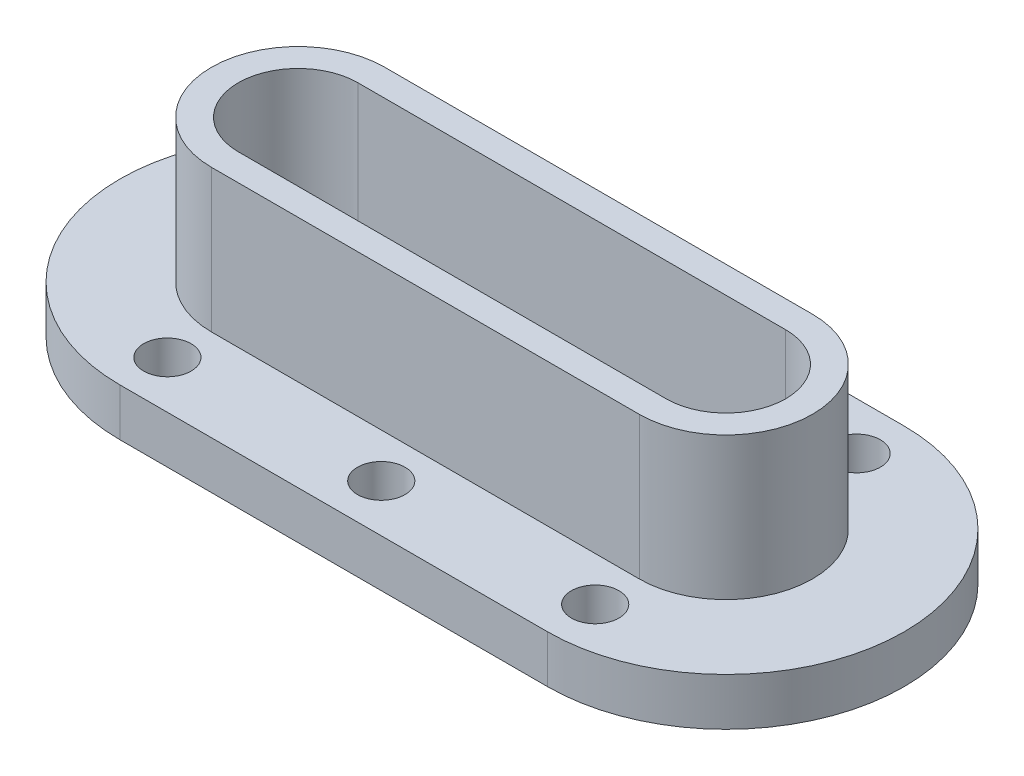
ISO-10303-21;
HEADER;
FILE_DESCRIPTION(('STEP AP214'),'2;1');
FILE_NAME('part.step','',(''),(''),'','','');
FILE_SCHEMA(('AUTOMOTIVE_DESIGN { 1 0 10303 214 1 1 1 1 }'));
ENDSEC;
DATA;
#1=APPLICATION_CONTEXT('core data for automotive mechanical design processes');
#2=APPLICATION_PROTOCOL_DEFINITION('international standard','automotive_design',2000,#1);
#3=PRODUCT_CONTEXT('',#1,'mechanical');
#4=PRODUCT('Part','Part','',(#3));
#5=PRODUCT_RELATED_PRODUCT_CATEGORY('part','',(#4));
#6=PRODUCT_DEFINITION_FORMATION('','',#4);
#7=PRODUCT_DEFINITION_CONTEXT('part definition',#1,'design');
#8=PRODUCT_DEFINITION('design','',#6,#7);
#9=PRODUCT_DEFINITION_SHAPE('','',#8);
#10=(LENGTH_UNIT() NAMED_UNIT(*) SI_UNIT(.MILLI.,.METRE.));
#11=(NAMED_UNIT(*) PLANE_ANGLE_UNIT() SI_UNIT($,.RADIAN.));
#12=(NAMED_UNIT(*) SI_UNIT($,.STERADIAN.) SOLID_ANGLE_UNIT());
#13=UNCERTAINTY_MEASURE_WITH_UNIT(LENGTH_MEASURE(1.E-05),#10,'distance_accuracy_value','');
#14=(GEOMETRIC_REPRESENTATION_CONTEXT(3) GLOBAL_UNCERTAINTY_ASSIGNED_CONTEXT((#13)) GLOBAL_UNIT_ASSIGNED_CONTEXT((#10,
#11,#12)) REPRESENTATION_CONTEXT('',''));
#15=CARTESIAN_POINT('',(0.,0.,0.));
#16=DIRECTION('',(0.,0.,1.));
#17=DIRECTION('',(1.,0.,0.));
#18=AXIS2_PLACEMENT_3D('',#15,#16,#17);
#19=CARTESIAN_POINT('',(-90.,20.,0.));
#20=DIRECTION('',(0.,1.,0.));
#21=DIRECTION('',(0.,0.,1.));
#22=AXIS2_PLACEMENT_3D('',#19,#20,#21);
#23=PLANE('',#22);
#24=CARTESIAN_POINT('',(90.,20.,55.));
#25=DIRECTION('',(0.,1.,0.));
#26=DIRECTION('',(0.,0.,1.));
#27=AXIS2_PLACEMENT_3D('',#24,#25,#26);
#28=CIRCLE('',#27,9.99999999999999);
#29=CARTESIAN_POINT('',(90.,20.,65.));
#30=VERTEX_POINT('',#29);
#31=EDGE_CURVE('E204',#30,#30,#28,.T.);
#32=ORIENTED_EDGE('',*,*,#31,.F.);
#33=EDGE_LOOP('',(#32));
#34=FACE_BOUND('',#33,.T.);
#35=CARTESIAN_POINT('',(0.,20.,55.));
#36=DIRECTION('',(0.,1.,0.));
#37=DIRECTION('',(0.,0.,1.));
#38=AXIS2_PLACEMENT_3D('',#35,#36,#37);
#39=CIRCLE('',#38,9.99999999999999);
#40=CARTESIAN_POINT('',(0.,20.,65.));
#41=VERTEX_POINT('',#40);
#42=EDGE_CURVE('E210',#41,#41,#39,.T.);
#43=ORIENTED_EDGE('',*,*,#42,.F.);
#44=EDGE_LOOP('',(#43));
#45=FACE_BOUND('',#44,.T.);
#46=CARTESIAN_POINT('',(-90.,20.,55.));
#47=DIRECTION('',(0.,1.,0.));
#48=DIRECTION('',(0.,0.,1.));
#49=AXIS2_PLACEMENT_3D('',#46,#47,#48);
#50=CIRCLE('',#49,9.99999999999999);
#51=CARTESIAN_POINT('',(-90.,20.,65.));
#52=VERTEX_POINT('',#51);
#53=EDGE_CURVE('E216',#52,#52,#50,.T.);
#54=ORIENTED_EDGE('',*,*,#53,.F.);
#55=EDGE_LOOP('',(#54));
#56=FACE_BOUND('',#55,.T.);
#57=CARTESIAN_POINT('',(90.,20.,-55.));
#58=DIRECTION('',(0.,1.,0.));
#59=DIRECTION('',(0.,0.,1.));
#60=AXIS2_PLACEMENT_3D('',#57,#58,#59);
#61=CIRCLE('',#60,9.99999999999999);
#62=CARTESIAN_POINT('',(90.,20.,-45.));
#63=VERTEX_POINT('',#62);
#64=EDGE_CURVE('E222',#63,#63,#61,.T.);
#65=ORIENTED_EDGE('',*,*,#64,.F.);
#66=EDGE_LOOP('',(#65));
#67=FACE_BOUND('',#66,.T.);
#68=CARTESIAN_POINT('',(0.,20.,-55.));
#69=DIRECTION('',(0.,1.,0.));
#70=DIRECTION('',(0.,0.,1.));
#71=AXIS2_PLACEMENT_3D('',#68,#69,#70);
#72=CIRCLE('',#71,9.99999999999999);
#73=CARTESIAN_POINT('',(0.,20.,-45.));
#74=VERTEX_POINT('',#73);
#75=EDGE_CURVE('E228',#74,#74,#72,.T.);
#76=ORIENTED_EDGE('',*,*,#75,.F.);
#77=EDGE_LOOP('',(#76));
#78=FACE_BOUND('',#77,.T.);
#79=CARTESIAN_POINT('',(-90.,20.,-55.));
#80=DIRECTION('',(0.,1.,0.));
#81=DIRECTION('',(0.,0.,1.));
#82=AXIS2_PLACEMENT_3D('',#79,#80,#81);
#83=CIRCLE('',#82,9.99999999999999);
#84=CARTESIAN_POINT('',(-90.,20.,-45.));
#85=VERTEX_POINT('',#84);
#86=EDGE_CURVE('E234',#85,#85,#83,.T.);
#87=ORIENTED_EDGE('',*,*,#86,.F.);
#88=EDGE_LOOP('',(#87));
#89=FACE_BOUND('',#88,.T.);
#90=CARTESIAN_POINT('',(-90.,20.,0.));
#91=DIRECTION('',(0.,1.,0.));
#92=DIRECTION('',(0.,0.,1.));
#93=AXIS2_PLACEMENT_3D('',#90,#91,#92);
#94=CIRCLE('',#93,75.);
#95=CARTESIAN_POINT('',(-90.,20.,-75.));
#96=VERTEX_POINT('',#95);
#97=CARTESIAN_POINT('',(-90.,20.,75.));
#98=VERTEX_POINT('',#97);
#99=EDGE_CURVE('E243',#96,#98,#94,.T.);
#100=ORIENTED_EDGE('',*,*,#99,.T.);
#101=DIRECTION('',(1.,0.,0.));
#102=VECTOR('',#101,1.);
#103=CARTESIAN_POINT('',(-90.,20.,75.));
#104=LINE('',#103,#102);
#105=CARTESIAN_POINT('',(90.,20.,75.));
#106=VERTEX_POINT('',#105);
#107=EDGE_CURVE('E246',#98,#106,#104,.T.);
#108=ORIENTED_EDGE('',*,*,#107,.T.);
#109=CARTESIAN_POINT('',(90.,20.,0.));
#110=DIRECTION('',(0.,1.,0.));
#111=DIRECTION('',(0.,0.,1.));
#112=AXIS2_PLACEMENT_3D('',#109,#110,#111);
#113=CIRCLE('',#112,75.);
#114=CARTESIAN_POINT('',(90.,20.,-75.));
#115=VERTEX_POINT('',#114);
#116=EDGE_CURVE('E249',#106,#115,#113,.T.);
#117=ORIENTED_EDGE('',*,*,#116,.T.);
#118=DIRECTION('',(-1.,0.,0.));
#119=VECTOR('',#118,1.);
#120=CARTESIAN_POINT('',(-90.,20.,-75.));
#121=LINE('',#120,#119);
#122=EDGE_CURVE('E251',#115,#96,#121,.T.);
#123=ORIENTED_EDGE('',*,*,#122,.T.);
#124=EDGE_LOOP('',(#100,#108,#117,#123));
#125=FACE_BOUND('',#124,.T.);
#126=DIRECTION('',(1.,0.,0.));
#127=VECTOR('',#126,1.);
#128=CARTESIAN_POINT('',(-90.,20.,36.456417916163));
#129=LINE('',#128,#127);
#130=CARTESIAN_POINT('',(-90.,20.,36.456417916163));
#131=VERTEX_POINT('',#130);
#132=CARTESIAN_POINT('',(90.,20.,36.456417916163));
#133=VERTEX_POINT('',#132);
#134=EDGE_CURVE('E175',#131,#133,#129,.T.);
#135=ORIENTED_EDGE('',*,*,#134,.F.);
#136=CARTESIAN_POINT('',(-90.,20.,0.));
#137=DIRECTION('',(0.,1.,0.));
#138=DIRECTION('',(0.,0.,-1.));
#139=AXIS2_PLACEMENT_3D('',#136,#137,#138);
#140=CIRCLE('',#139,36.456417916163);
#141=CARTESIAN_POINT('',(-90.,20.,-36.456417916163));
#142=VERTEX_POINT('',#141);
#143=EDGE_CURVE('E140',#142,#131,#140,.T.);
#144=ORIENTED_EDGE('',*,*,#143,.F.);
#145=DIRECTION('',(-1.,0.,0.));
#146=VECTOR('',#145,1.);
#147=CARTESIAN_POINT('',(-90.,20.,-36.456417916163));
#148=LINE('',#147,#146);
#149=CARTESIAN_POINT('',(90.,20.,-36.456417916163));
#150=VERTEX_POINT('',#149);
#151=EDGE_CURVE('E166',#150,#142,#148,.T.);
#152=ORIENTED_EDGE('',*,*,#151,.F.);
#153=CARTESIAN_POINT('',(90.,20.,0.));
#154=DIRECTION('',(0.,1.,0.));
#155=DIRECTION('',(0.,0.,1.));
#156=AXIS2_PLACEMENT_3D('',#153,#154,#155);
#157=CIRCLE('',#156,36.456417916163);
#158=EDGE_CURVE('E177',#133,#150,#157,.T.);
#159=ORIENTED_EDGE('',*,*,#158,.F.);
#160=EDGE_LOOP('',(#135,#144,#152,#159));
#161=FACE_BOUND('',#160,.T.);
#162=ADVANCED_FACE('F32',(#34,#45,#56,#67,#78,#89,#125,#161),#23,.T.);
#163=CARTESIAN_POINT('',(-90.,20.,0.));
#164=DIRECTION('',(0.,-1.,0.));
#165=DIRECTION('',(0.,0.,-1.));
#166=AXIS2_PLACEMENT_3D('',#163,#164,#165);
#167=CYLINDRICAL_SURFACE('',#166,75.);
#168=CARTESIAN_POINT('',(-90.,0.,0.));
#169=DIRECTION('',(0.,1.,0.));
#170=DIRECTION('',(0.,0.,1.));
#171=AXIS2_PLACEMENT_3D('',#168,#169,#170);
#172=CIRCLE('',#171,75.);
#173=CARTESIAN_POINT('',(-90.,0.,-75.));
#174=VERTEX_POINT('',#173);
#175=CARTESIAN_POINT('',(-90.,0.,75.));
#176=VERTEX_POINT('',#175);
#177=EDGE_CURVE('E240',#174,#176,#172,.T.);
#178=ORIENTED_EDGE('',*,*,#177,.T.);
#179=DIRECTION('',(0.,-1.,0.));
#180=VECTOR('',#179,1.);
#181=CARTESIAN_POINT('',(-90.,20.,75.));
#182=LINE('',#181,#180);
#183=EDGE_CURVE('E11',#98,#176,#182,.T.);
#184=ORIENTED_EDGE('',*,*,#183,.F.);
#185=ORIENTED_EDGE('',*,*,#99,.F.);
#186=DIRECTION('',(0.,-1.,0.));
#187=VECTOR('',#186,1.);
#188=CARTESIAN_POINT('',(-90.,20.,-75.));
#189=LINE('',#188,#187);
#190=EDGE_CURVE('E253',#96,#174,#189,.T.);
#191=ORIENTED_EDGE('',*,*,#190,.T.);
#192=EDGE_LOOP('',(#178,#184,#185,#191));
#193=FACE_BOUND('',#192,.T.);
#194=ADVANCED_FACE('F34',(#193),#167,.T.);
#195=CARTESIAN_POINT('',(-90.,20.,75.));
#196=DIRECTION('',(0.,0.,-1.));
#197=DIRECTION('',(-1.,0.,0.));
#198=AXIS2_PLACEMENT_3D('',#195,#196,#197);
#199=PLANE('',#198);
#200=DIRECTION('',(1.,0.,0.));
#201=VECTOR('',#200,1.);
#202=CARTESIAN_POINT('',(-90.,0.,75.));
#203=LINE('',#202,#201);
#204=CARTESIAN_POINT('',(90.,0.,75.));
#205=VERTEX_POINT('',#204);
#206=EDGE_CURVE('E256',#176,#205,#203,.T.);
#207=ORIENTED_EDGE('',*,*,#206,.T.);
#208=DIRECTION('',(0.,-1.,0.));
#209=VECTOR('',#208,1.);
#210=CARTESIAN_POINT('',(90.,20.,75.));
#211=LINE('',#210,#209);
#212=EDGE_CURVE('E40',#106,#205,#211,.T.);
#213=ORIENTED_EDGE('',*,*,#212,.F.);
#214=ORIENTED_EDGE('',*,*,#107,.F.);
#215=ORIENTED_EDGE('',*,*,#183,.T.);
#216=EDGE_LOOP('',(#207,#213,#214,#215));
#217=FACE_BOUND('',#216,.T.);
#218=ADVANCED_FACE('F286',(#217),#199,.F.);
#219=CARTESIAN_POINT('',(90.,20.,0.));
#220=DIRECTION('',(0.,-1.,0.));
#221=DIRECTION('',(0.,0.,-1.));
#222=AXIS2_PLACEMENT_3D('',#219,#220,#221);
#223=CYLINDRICAL_SURFACE('',#222,75.);
#224=CARTESIAN_POINT('',(90.,0.,0.));
#225=DIRECTION('',(0.,1.,0.));
#226=DIRECTION('',(0.,0.,1.));
#227=AXIS2_PLACEMENT_3D('',#224,#225,#226);
#228=CIRCLE('',#227,75.);
#229=CARTESIAN_POINT('',(90.,0.,-75.));
#230=VERTEX_POINT('',#229);
#231=EDGE_CURVE('E258',#205,#230,#228,.T.);
#232=ORIENTED_EDGE('',*,*,#231,.T.);
#233=DIRECTION('',(0.,-1.,0.));
#234=VECTOR('',#233,1.);
#235=CARTESIAN_POINT('',(90.,20.,-75.));
#236=LINE('',#235,#234);
#237=EDGE_CURVE('E263',#115,#230,#236,.T.);
#238=ORIENTED_EDGE('',*,*,#237,.F.);
#239=ORIENTED_EDGE('',*,*,#116,.F.);
#240=ORIENTED_EDGE('',*,*,#212,.T.);
#241=EDGE_LOOP('',(#232,#238,#239,#240));
#242=FACE_BOUND('',#241,.T.);
#243=ADVANCED_FACE('F270',(#242),#223,.T.);
#244=CARTESIAN_POINT('',(-90.,20.,-75.));
#245=DIRECTION('',(0.,0.,1.));
#246=DIRECTION('',(1.,0.,0.));
#247=AXIS2_PLACEMENT_3D('',#244,#245,#246);
#248=PLANE('',#247);
#249=DIRECTION('',(-1.,0.,0.));
#250=VECTOR('',#249,1.);
#251=CARTESIAN_POINT('',(-90.,0.,-75.));
#252=LINE('',#251,#250);
#253=EDGE_CURVE('E247',#230,#174,#252,.T.);
#254=ORIENTED_EDGE('',*,*,#253,.T.);
#255=ORIENTED_EDGE('',*,*,#190,.F.);
#256=ORIENTED_EDGE('',*,*,#122,.F.);
#257=ORIENTED_EDGE('',*,*,#237,.T.);
#258=EDGE_LOOP('',(#254,#255,#256,#257));
#259=FACE_BOUND('',#258,.T.);
#260=ADVANCED_FACE('F279',(#259),#248,.F.);
#261=CARTESIAN_POINT('',(-90.,20.,0.));
#262=DIRECTION('',(0.,1.,0.));
#263=DIRECTION('',(0.,0.,-1.));
#264=AXIS2_PLACEMENT_3D('',#261,#262,#263);
#265=CIRCLE('',#264,25.1602923101474);
#266=CARTESIAN_POINT('',(-90.,20.,-25.1602923101474));
#267=VERTEX_POINT('',#266);
#268=CARTESIAN_POINT('',(-90.,20.,25.1602923101474));
#269=VERTEX_POINT('',#268);
#270=EDGE_CURVE('E55',#267,#269,#265,.T.);
#271=ORIENTED_EDGE('',*,*,#270,.T.);
#272=DIRECTION('',(1.,0.,0.));
#273=VECTOR('',#272,1.);
#274=CARTESIAN_POINT('',(-90.,20.,25.1602923101474));
#275=LINE('',#274,#273);
#276=CARTESIAN_POINT('',(90.,20.,25.1602923101474));
#277=VERTEX_POINT('',#276);
#278=EDGE_CURVE('E139',#269,#277,#275,.T.);
#279=ORIENTED_EDGE('',*,*,#278,.T.);
#280=CARTESIAN_POINT('',(90.,20.,0.));
#281=DIRECTION('',(0.,1.,0.));
#282=DIRECTION('',(0.,0.,1.));
#283=AXIS2_PLACEMENT_3D('',#280,#281,#282);
#284=CIRCLE('',#283,25.1602923101474);
#285=CARTESIAN_POINT('',(90.,20.,-25.1602923101474));
#286=VERTEX_POINT('',#285);
#287=EDGE_CURVE('E154',#277,#286,#284,.T.);
#288=ORIENTED_EDGE('',*,*,#287,.T.);
#289=DIRECTION('',(-1.,0.,0.));
#290=VECTOR('',#289,1.);
#291=CARTESIAN_POINT('',(-90.,20.,-25.1602923101474));
#292=LINE('',#291,#290);
#293=EDGE_CURVE('E133',#286,#267,#292,.T.);
#294=ORIENTED_EDGE('',*,*,#293,.T.);
#295=EDGE_LOOP('',(#271,#279,#288,#294));
#296=FACE_BOUND('',#295,.T.);
#297=CARTESIAN_POINT('',(90.,20.,0.));
#298=DIRECTION('',(0.,1.,0.));
#299=DIRECTION('',(0.,0.,1.));
#300=AXIS2_PLACEMENT_3D('',#297,#298,#299);
#301=CIRCLE('',#300,7.50000000000001);
#302=CARTESIAN_POINT('',(90.,20.,7.50000000000001));
#303=VERTEX_POINT('',#302);
#304=EDGE_CURVE('E188',#303,#303,#301,.T.);
#305=ORIENTED_EDGE('',*,*,#304,.F.);
#306=EDGE_LOOP('',(#305));
#307=FACE_BOUND('',#306,.T.);
#308=CARTESIAN_POINT('',(0.,20.,0.));
#309=DIRECTION('',(0.,1.,0.));
#310=DIRECTION('',(0.,0.,1.));
#311=AXIS2_PLACEMENT_3D('',#308,#309,#310);
#312=CIRCLE('',#311,7.50000000000001);
#313=CARTESIAN_POINT('',(0.,20.,7.50000000000001));
#314=VERTEX_POINT('',#313);
#315=EDGE_CURVE('E192',#314,#314,#312,.T.);
#316=ORIENTED_EDGE('',*,*,#315,.F.);
#317=EDGE_LOOP('',(#316));
#318=FACE_BOUND('',#317,.T.);
#319=CARTESIAN_POINT('',(-90.,20.,0.));
#320=DIRECTION('',(0.,1.,0.));
#321=DIRECTION('',(0.,0.,1.));
#322=AXIS2_PLACEMENT_3D('',#319,#320,#321);
#323=CIRCLE('',#322,7.50000000000001);
#324=CARTESIAN_POINT('',(-90.,20.,7.50000000000001));
#325=VERTEX_POINT('',#324);
#326=EDGE_CURVE('E198',#325,#325,#323,.T.);
#327=ORIENTED_EDGE('',*,*,#326,.F.);
#328=EDGE_LOOP('',(#327));
#329=FACE_BOUND('',#328,.T.);
#330=ADVANCED_FACE('F296',(#296,#307,#318,#329),#23,.T.);
#331=CARTESIAN_POINT('',(-90.,0.,0.));
#332=DIRECTION('',(0.,1.,0.));
#333=DIRECTION('',(0.,0.,1.));
#334=AXIS2_PLACEMENT_3D('',#331,#332,#333);
#335=PLANE('',#334);
#336=CARTESIAN_POINT('',(90.,0.,0.));
#337=DIRECTION('',(0.,1.,0.));
#338=DIRECTION('',(0.,0.,1.));
#339=AXIS2_PLACEMENT_3D('',#336,#337,#338);
#340=CIRCLE('',#339,7.50000000000001);
#341=CARTESIAN_POINT('',(90.,0.,7.50000000000001));
#342=VERTEX_POINT('',#341);
#343=EDGE_CURVE('E189',#342,#342,#340,.T.);
#344=ORIENTED_EDGE('',*,*,#343,.T.);
#345=EDGE_LOOP('',(#344));
#346=FACE_BOUND('',#345,.T.);
#347=CARTESIAN_POINT('',(0.,0.,0.));
#348=DIRECTION('',(0.,1.,0.));
#349=DIRECTION('',(0.,0.,1.));
#350=AXIS2_PLACEMENT_3D('',#347,#348,#349);
#351=CIRCLE('',#350,7.50000000000001);
#352=CARTESIAN_POINT('',(0.,0.,7.50000000000001));
#353=VERTEX_POINT('',#352);
#354=EDGE_CURVE('E195',#353,#353,#351,.T.);
#355=ORIENTED_EDGE('',*,*,#354,.T.);
#356=EDGE_LOOP('',(#355));
#357=FACE_BOUND('',#356,.T.);
#358=CARTESIAN_POINT('',(-90.,0.,0.));
#359=DIRECTION('',(0.,1.,0.));
#360=DIRECTION('',(0.,0.,1.));
#361=AXIS2_PLACEMENT_3D('',#358,#359,#360);
#362=CIRCLE('',#361,7.50000000000001);
#363=CARTESIAN_POINT('',(-90.,0.,7.50000000000001));
#364=VERTEX_POINT('',#363);
#365=EDGE_CURVE('E201',#364,#364,#362,.T.);
#366=ORIENTED_EDGE('',*,*,#365,.T.);
#367=EDGE_LOOP('',(#366));
#368=FACE_BOUND('',#367,.T.);
#369=CARTESIAN_POINT('',(90.,0.,55.));
#370=DIRECTION('',(0.,1.,0.));
#371=DIRECTION('',(0.,0.,1.));
#372=AXIS2_PLACEMENT_3D('',#369,#370,#371);
#373=CIRCLE('',#372,9.99999999999999);
#374=CARTESIAN_POINT('',(90.,0.,65.));
#375=VERTEX_POINT('',#374);
#376=EDGE_CURVE('E207',#375,#375,#373,.T.);
#377=ORIENTED_EDGE('',*,*,#376,.T.);
#378=EDGE_LOOP('',(#377));
#379=FACE_BOUND('',#378,.T.);
#380=CARTESIAN_POINT('',(0.,0.,55.));
#381=DIRECTION('',(0.,1.,0.));
#382=DIRECTION('',(0.,0.,1.));
#383=AXIS2_PLACEMENT_3D('',#380,#381,#382);
#384=CIRCLE('',#383,9.99999999999999);
#385=CARTESIAN_POINT('',(0.,0.,65.));
#386=VERTEX_POINT('',#385);
#387=EDGE_CURVE('E213',#386,#386,#384,.T.);
#388=ORIENTED_EDGE('',*,*,#387,.T.);
#389=EDGE_LOOP('',(#388));
#390=FACE_BOUND('',#389,.T.);
#391=CARTESIAN_POINT('',(-90.,0.,55.));
#392=DIRECTION('',(0.,1.,0.));
#393=DIRECTION('',(0.,0.,1.));
#394=AXIS2_PLACEMENT_3D('',#391,#392,#393);
#395=CIRCLE('',#394,9.99999999999999);
#396=CARTESIAN_POINT('',(-90.,0.,65.));
#397=VERTEX_POINT('',#396);
#398=EDGE_CURVE('E219',#397,#397,#395,.T.);
#399=ORIENTED_EDGE('',*,*,#398,.T.);
#400=EDGE_LOOP('',(#399));
#401=FACE_BOUND('',#400,.T.);
#402=CARTESIAN_POINT('',(90.,0.,-55.));
#403=DIRECTION('',(0.,1.,0.));
#404=DIRECTION('',(0.,0.,1.));
#405=AXIS2_PLACEMENT_3D('',#402,#403,#404);
#406=CIRCLE('',#405,9.99999999999999);
#407=CARTESIAN_POINT('',(90.,0.,-45.));
#408=VERTEX_POINT('',#407);
#409=EDGE_CURVE('E225',#408,#408,#406,.T.);
#410=ORIENTED_EDGE('',*,*,#409,.T.);
#411=EDGE_LOOP('',(#410));
#412=FACE_BOUND('',#411,.T.);
#413=CARTESIAN_POINT('',(0.,0.,-55.));
#414=DIRECTION('',(0.,1.,0.));
#415=DIRECTION('',(0.,0.,1.));
#416=AXIS2_PLACEMENT_3D('',#413,#414,#415);
#417=CIRCLE('',#416,9.99999999999999);
#418=CARTESIAN_POINT('',(0.,0.,-45.));
#419=VERTEX_POINT('',#418);
#420=EDGE_CURVE('E231',#419,#419,#417,.T.);
#421=ORIENTED_EDGE('',*,*,#420,.T.);
#422=EDGE_LOOP('',(#421));
#423=FACE_BOUND('',#422,.T.);
#424=CARTESIAN_POINT('',(-90.,0.,-55.));
#425=DIRECTION('',(0.,1.,0.));
#426=DIRECTION('',(0.,0.,1.));
#427=AXIS2_PLACEMENT_3D('',#424,#425,#426);
#428=CIRCLE('',#427,9.99999999999999);
#429=CARTESIAN_POINT('',(-90.,0.,-45.));
#430=VERTEX_POINT('',#429);
#431=EDGE_CURVE('E237',#430,#430,#428,.T.);
#432=ORIENTED_EDGE('',*,*,#431,.T.);
#433=EDGE_LOOP('',(#432));
#434=FACE_BOUND('',#433,.T.);
#435=ORIENTED_EDGE('',*,*,#177,.F.);
#436=ORIENTED_EDGE('',*,*,#253,.F.);
#437=ORIENTED_EDGE('',*,*,#231,.F.);
#438=ORIENTED_EDGE('',*,*,#206,.F.);
#439=EDGE_LOOP('',(#435,#436,#437,#438));
#440=FACE_BOUND('',#439,.T.);
#441=ADVANCED_FACE('F276',(#346,#357,#368,#379,#390,#401,#412,#423,#434,#440),#335,.F.);
#442=CARTESIAN_POINT('',(-90.,0.,-55.));
#443=DIRECTION('',(0.,1.,0.));
#444=DIRECTION('',(0.,0.,1.));
#445=AXIS2_PLACEMENT_3D('',#442,#443,#444);
#446=CYLINDRICAL_SURFACE('',#445,9.99999999999999);
#447=ORIENTED_EDGE('',*,*,#431,.F.);
#448=EDGE_LOOP('',(#447));
#449=FACE_BOUND('',#448,.T.);
#450=ORIENTED_EDGE('',*,*,#86,.T.);
#451=EDGE_LOOP('',(#450));
#452=FACE_BOUND('',#451,.T.);
#453=ADVANCED_FACE('F308',(#449,#452),#446,.F.);
#454=CARTESIAN_POINT('',(0.,0.,-55.));
#455=DIRECTION('',(0.,1.,0.));
#456=DIRECTION('',(0.,0.,1.));
#457=AXIS2_PLACEMENT_3D('',#454,#455,#456);
#458=CYLINDRICAL_SURFACE('',#457,9.99999999999999);
#459=ORIENTED_EDGE('',*,*,#420,.F.);
#460=EDGE_LOOP('',(#459));
#461=FACE_BOUND('',#460,.T.);
#462=ORIENTED_EDGE('',*,*,#75,.T.);
#463=EDGE_LOOP('',(#462));
#464=FACE_BOUND('',#463,.T.);
#465=ADVANCED_FACE('F347',(#461,#464),#458,.F.);
#466=CARTESIAN_POINT('',(90.,0.,-55.));
#467=DIRECTION('',(0.,1.,0.));
#468=DIRECTION('',(0.,0.,1.));
#469=AXIS2_PLACEMENT_3D('',#466,#467,#468);
#470=CYLINDRICAL_SURFACE('',#469,9.99999999999999);
#471=ORIENTED_EDGE('',*,*,#409,.F.);
#472=EDGE_LOOP('',(#471));
#473=FACE_BOUND('',#472,.T.);
#474=ORIENTED_EDGE('',*,*,#64,.T.);
#475=EDGE_LOOP('',(#474));
#476=FACE_BOUND('',#475,.T.);
#477=ADVANCED_FACE('F343',(#473,#476),#470,.F.);
#478=CARTESIAN_POINT('',(-90.,0.,55.));
#479=DIRECTION('',(0.,1.,0.));
#480=DIRECTION('',(0.,0.,1.));
#481=AXIS2_PLACEMENT_3D('',#478,#479,#480);
#482=CYLINDRICAL_SURFACE('',#481,9.99999999999999);
#483=ORIENTED_EDGE('',*,*,#398,.F.);
#484=EDGE_LOOP('',(#483));
#485=FACE_BOUND('',#484,.T.);
#486=ORIENTED_EDGE('',*,*,#53,.T.);
#487=EDGE_LOOP('',(#486));
#488=FACE_BOUND('',#487,.T.);
#489=ADVANCED_FACE('F339',(#485,#488),#482,.F.);
#490=CARTESIAN_POINT('',(0.,0.,55.));
#491=DIRECTION('',(0.,1.,0.));
#492=DIRECTION('',(0.,0.,1.));
#493=AXIS2_PLACEMENT_3D('',#490,#491,#492);
#494=CYLINDRICAL_SURFACE('',#493,9.99999999999999);
#495=ORIENTED_EDGE('',*,*,#387,.F.);
#496=EDGE_LOOP('',(#495));
#497=FACE_BOUND('',#496,.T.);
#498=ORIENTED_EDGE('',*,*,#42,.T.);
#499=EDGE_LOOP('',(#498));
#500=FACE_BOUND('',#499,.T.);
#501=ADVANCED_FACE('F331',(#497,#500),#494,.F.);
#502=CARTESIAN_POINT('',(90.,0.,55.));
#503=DIRECTION('',(0.,1.,0.));
#504=DIRECTION('',(0.,0.,1.));
#505=AXIS2_PLACEMENT_3D('',#502,#503,#504);
#506=CYLINDRICAL_SURFACE('',#505,9.99999999999999);
#507=ORIENTED_EDGE('',*,*,#376,.F.);
#508=EDGE_LOOP('',(#507));
#509=FACE_BOUND('',#508,.T.);
#510=ORIENTED_EDGE('',*,*,#31,.T.);
#511=EDGE_LOOP('',(#510));
#512=FACE_BOUND('',#511,.T.);
#513=ADVANCED_FACE('F321',(#509,#512),#506,.F.);
#514=CARTESIAN_POINT('',(-90.,0.,0.));
#515=DIRECTION('',(0.,1.,0.));
#516=DIRECTION('',(0.,0.,1.));
#517=AXIS2_PLACEMENT_3D('',#514,#515,#516);
#518=CYLINDRICAL_SURFACE('',#517,7.50000000000001);
#519=ORIENTED_EDGE('',*,*,#365,.F.);
#520=EDGE_LOOP('',(#519));
#521=FACE_BOUND('',#520,.T.);
#522=ORIENTED_EDGE('',*,*,#326,.T.);
#523=EDGE_LOOP('',(#522));
#524=FACE_BOUND('',#523,.T.);
#525=ADVANCED_FACE('F318',(#521,#524),#518,.F.);
#526=CARTESIAN_POINT('',(0.,0.,0.));
#527=DIRECTION('',(0.,1.,0.));
#528=DIRECTION('',(0.,0.,1.));
#529=AXIS2_PLACEMENT_3D('',#526,#527,#528);
#530=CYLINDRICAL_SURFACE('',#529,7.50000000000001);
#531=ORIENTED_EDGE('',*,*,#354,.F.);
#532=EDGE_LOOP('',(#531));
#533=FACE_BOUND('',#532,.T.);
#534=ORIENTED_EDGE('',*,*,#315,.T.);
#535=EDGE_LOOP('',(#534));
#536=FACE_BOUND('',#535,.T.);
#537=ADVANCED_FACE('F320',(#533,#536),#530,.F.);
#538=CARTESIAN_POINT('',(90.,0.,0.));
#539=DIRECTION('',(0.,1.,0.));
#540=DIRECTION('',(0.,0.,1.));
#541=AXIS2_PLACEMENT_3D('',#538,#539,#540);
#542=CYLINDRICAL_SURFACE('',#541,7.50000000000001);
#543=ORIENTED_EDGE('',*,*,#343,.F.);
#544=EDGE_LOOP('',(#543));
#545=FACE_BOUND('',#544,.T.);
#546=ORIENTED_EDGE('',*,*,#304,.T.);
#547=EDGE_LOOP('',(#546));
#548=FACE_BOUND('',#547,.T.);
#549=ADVANCED_FACE('F328',(#545,#548),#542,.F.);
#550=CARTESIAN_POINT('',(-90.,80.,0.));
#551=DIRECTION('',(0.,-1.,0.));
#552=DIRECTION('',(0.,0.,-1.));
#553=AXIS2_PLACEMENT_3D('',#550,#551,#552);
#554=PLANE('',#553);
#555=CARTESIAN_POINT('',(-90.,80.,0.));
#556=DIRECTION('',(0.,1.,0.));
#557=DIRECTION('',(0.,0.,-1.));
#558=AXIS2_PLACEMENT_3D('',#555,#556,#557);
#559=CIRCLE('',#558,36.456417916163);
#560=CARTESIAN_POINT('',(-90.,80.,-36.456417916163));
#561=VERTEX_POINT('',#560);
#562=CARTESIAN_POINT('',(-90.,80.,36.456417916163));
#563=VERTEX_POINT('',#562);
#564=EDGE_CURVE('E162',#561,#563,#559,.T.);
#565=ORIENTED_EDGE('',*,*,#564,.T.);
#566=DIRECTION('',(1.,0.,0.));
#567=VECTOR('',#566,1.);
#568=CARTESIAN_POINT('',(-90.,80.,36.456417916163));
#569=LINE('',#568,#567);
#570=CARTESIAN_POINT('',(90.,80.,36.456417916163));
#571=VERTEX_POINT('',#570);
#572=EDGE_CURVE('E165',#563,#571,#569,.T.);
#573=ORIENTED_EDGE('',*,*,#572,.T.);
#574=CARTESIAN_POINT('',(90.,80.,0.));
#575=DIRECTION('',(0.,1.,0.));
#576=DIRECTION('',(0.,0.,1.));
#577=AXIS2_PLACEMENT_3D('',#574,#575,#576);
#578=CIRCLE('',#577,36.456417916163);
#579=CARTESIAN_POINT('',(90.,80.,-36.456417916163));
#580=VERTEX_POINT('',#579);
#581=EDGE_CURVE('E168',#571,#580,#578,.T.);
#582=ORIENTED_EDGE('',*,*,#581,.T.);
#583=DIRECTION('',(-1.,0.,0.));
#584=VECTOR('',#583,1.);
#585=CARTESIAN_POINT('',(-90.,80.,-36.456417916163));
#586=LINE('',#585,#584);
#587=EDGE_CURVE('E170',#580,#561,#586,.T.);
#588=ORIENTED_EDGE('',*,*,#587,.T.);
#589=EDGE_LOOP('',(#565,#573,#582,#588));
#590=FACE_BOUND('',#589,.T.);
#591=CARTESIAN_POINT('',(-90.,80.,0.));
#592=DIRECTION('',(0.,1.,0.));
#593=DIRECTION('',(0.,0.,-1.));
#594=AXIS2_PLACEMENT_3D('',#591,#592,#593);
#595=CIRCLE('',#594,25.1602923101474);
#596=CARTESIAN_POINT('',(-90.,80.,-25.1602923101474));
#597=VERTEX_POINT('',#596);
#598=CARTESIAN_POINT('',(-90.,80.,25.1602923101474));
#599=VERTEX_POINT('',#598);
#600=EDGE_CURVE('E123',#597,#599,#595,.T.);
#601=ORIENTED_EDGE('',*,*,#600,.F.);
#602=DIRECTION('',(-1.,0.,0.));
#603=VECTOR('',#602,1.);
#604=CARTESIAN_POINT('',(-90.,80.,-25.1602923101474));
#605=LINE('',#604,#603);
#606=CARTESIAN_POINT('',(90.,80.,-25.1602923101474));
#607=VERTEX_POINT('',#606);
#608=EDGE_CURVE('E148',#607,#597,#605,.T.);
#609=ORIENTED_EDGE('',*,*,#608,.F.);
#610=CARTESIAN_POINT('',(90.,80.,0.));
#611=DIRECTION('',(0.,1.,0.));
#612=DIRECTION('',(0.,0.,1.));
#613=AXIS2_PLACEMENT_3D('',#610,#611,#612);
#614=CIRCLE('',#613,25.1602923101474);
#615=CARTESIAN_POINT('',(90.,80.,25.1602923101474));
#616=VERTEX_POINT('',#615);
#617=EDGE_CURVE('E146',#616,#607,#614,.T.);
#618=ORIENTED_EDGE('',*,*,#617,.F.);
#619=DIRECTION('',(1.,0.,0.));
#620=VECTOR('',#619,1.);
#621=CARTESIAN_POINT('',(-90.,80.,25.1602923101474));
#622=LINE('',#621,#620);
#623=EDGE_CURVE('E132',#599,#616,#622,.T.);
#624=ORIENTED_EDGE('',*,*,#623,.F.);
#625=EDGE_LOOP('',(#601,#609,#618,#624));
#626=FACE_BOUND('',#625,.T.);
#627=ADVANCED_FACE('F144',(#590,#626),#554,.F.);
#628=CARTESIAN_POINT('',(-90.,80.,0.));
#629=DIRECTION('',(0.,-1.,0.));
#630=DIRECTION('',(0.,0.,-1.));
#631=AXIS2_PLACEMENT_3D('',#628,#629,#630);
#632=CYLINDRICAL_SURFACE('',#631,36.456417916163);
#633=ORIENTED_EDGE('',*,*,#143,.T.);
#634=DIRECTION('',(0.,-1.,0.));
#635=VECTOR('',#634,1.);
#636=CARTESIAN_POINT('',(-90.,80.,36.456417916163));
#637=LINE('',#636,#635);
#638=EDGE_CURVE('E186',#563,#131,#637,.T.);
#639=ORIENTED_EDGE('',*,*,#638,.F.);
#640=ORIENTED_EDGE('',*,*,#564,.F.);
#641=DIRECTION('',(0.,-1.,0.));
#642=VECTOR('',#641,1.);
#643=CARTESIAN_POINT('',(-90.,80.,-36.456417916163));
#644=LINE('',#643,#642);
#645=EDGE_CURVE('E172',#561,#142,#644,.T.);
#646=ORIENTED_EDGE('',*,*,#645,.T.);
#647=EDGE_LOOP('',(#633,#639,#640,#646));
#648=FACE_BOUND('',#647,.T.);
#649=ADVANCED_FACE('F423',(#648),#632,.T.);
#650=CARTESIAN_POINT('',(-90.,80.,36.456417916163));
#651=DIRECTION('',(0.,0.,-1.));
#652=DIRECTION('',(-1.,0.,0.));
#653=AXIS2_PLACEMENT_3D('',#650,#651,#652);
#654=PLANE('',#653);
#655=ORIENTED_EDGE('',*,*,#134,.T.);
#656=DIRECTION('',(0.,-1.,0.));
#657=VECTOR('',#656,1.);
#658=CARTESIAN_POINT('',(90.,80.,36.456417916163));
#659=LINE('',#658,#657);
#660=EDGE_CURVE('E183',#571,#133,#659,.T.);
#661=ORIENTED_EDGE('',*,*,#660,.F.);
#662=ORIENTED_EDGE('',*,*,#572,.F.);
#663=ORIENTED_EDGE('',*,*,#638,.T.);
#664=EDGE_LOOP('',(#655,#661,#662,#663));
#665=FACE_BOUND('',#664,.T.);
#666=ADVANCED_FACE('F433',(#665),#654,.F.);
#667=CARTESIAN_POINT('',(90.,80.,0.));
#668=DIRECTION('',(0.,-1.,0.));
#669=DIRECTION('',(0.,0.,-1.));
#670=AXIS2_PLACEMENT_3D('',#667,#668,#669);
#671=CYLINDRICAL_SURFACE('',#670,36.456417916163);
#672=ORIENTED_EDGE('',*,*,#158,.T.);
#673=DIRECTION('',(0.,-1.,0.));
#674=VECTOR('',#673,1.);
#675=CARTESIAN_POINT('',(90.,80.,-36.456417916163));
#676=LINE('',#675,#674);
#677=EDGE_CURVE('E47',#580,#150,#676,.T.);
#678=ORIENTED_EDGE('',*,*,#677,.F.);
#679=ORIENTED_EDGE('',*,*,#581,.F.);
#680=ORIENTED_EDGE('',*,*,#660,.T.);
#681=EDGE_LOOP('',(#672,#678,#679,#680));
#682=FACE_BOUND('',#681,.T.);
#683=ADVANCED_FACE('F443',(#682),#671,.T.);
#684=CARTESIAN_POINT('',(-90.,80.,-36.456417916163));
#685=DIRECTION('',(0.,0.,1.));
#686=DIRECTION('',(1.,0.,0.));
#687=AXIS2_PLACEMENT_3D('',#684,#685,#686);
#688=PLANE('',#687);
#689=ORIENTED_EDGE('',*,*,#151,.T.);
#690=ORIENTED_EDGE('',*,*,#645,.F.);
#691=ORIENTED_EDGE('',*,*,#587,.F.);
#692=ORIENTED_EDGE('',*,*,#677,.T.);
#693=EDGE_LOOP('',(#689,#690,#691,#692));
#694=FACE_BOUND('',#693,.T.);
#695=ADVANCED_FACE('F453',(#694),#688,.F.);
#696=CARTESIAN_POINT('',(-90.,80.,0.));
#697=DIRECTION('',(0.,-1.,0.));
#698=DIRECTION('',(0.,0.,-1.));
#699=AXIS2_PLACEMENT_3D('',#696,#697,#698);
#700=CYLINDRICAL_SURFACE('',#699,25.1602923101474);
#701=ORIENTED_EDGE('',*,*,#270,.F.);
#702=DIRECTION('',(0.,-1.,0.));
#703=VECTOR('',#702,1.);
#704=CARTESIAN_POINT('',(-90.,80.,-25.1602923101474));
#705=LINE('',#704,#703);
#706=EDGE_CURVE('E128',#597,#267,#705,.T.);
#707=ORIENTED_EDGE('',*,*,#706,.F.);
#708=ORIENTED_EDGE('',*,*,#600,.T.);
#709=DIRECTION('',(0.,-1.,0.));
#710=VECTOR('',#709,1.);
#711=CARTESIAN_POINT('',(-90.,80.,25.1602923101474));
#712=LINE('',#711,#710);
#713=EDGE_CURVE('E126',#599,#269,#712,.T.);
#714=ORIENTED_EDGE('',*,*,#713,.T.);
#715=EDGE_LOOP('',(#701,#707,#708,#714));
#716=FACE_BOUND('',#715,.T.);
#717=ADVANCED_FACE('F125',(#716),#700,.F.);
#718=CARTESIAN_POINT('',(-90.,80.,25.1602923101474));
#719=DIRECTION('',(0.,0.,-1.));
#720=DIRECTION('',(-1.,0.,0.));
#721=AXIS2_PLACEMENT_3D('',#718,#719,#720);
#722=PLANE('',#721);
#723=ORIENTED_EDGE('',*,*,#278,.F.);
#724=ORIENTED_EDGE('',*,*,#713,.F.);
#725=ORIENTED_EDGE('',*,*,#623,.T.);
#726=DIRECTION('',(0.,-1.,0.));
#727=VECTOR('',#726,1.);
#728=CARTESIAN_POINT('',(90.,80.,25.1602923101474));
#729=LINE('',#728,#727);
#730=EDGE_CURVE('E141',#616,#277,#729,.T.);
#731=ORIENTED_EDGE('',*,*,#730,.T.);
#732=EDGE_LOOP('',(#723,#724,#725,#731));
#733=FACE_BOUND('',#732,.T.);
#734=ADVANCED_FACE('F136',(#733),#722,.T.);
#735=CARTESIAN_POINT('',(90.,80.,0.));
#736=DIRECTION('',(0.,-1.,0.));
#737=DIRECTION('',(0.,0.,-1.));
#738=AXIS2_PLACEMENT_3D('',#735,#736,#737);
#739=CYLINDRICAL_SURFACE('',#738,25.1602923101474);
#740=ORIENTED_EDGE('',*,*,#287,.F.);
#741=ORIENTED_EDGE('',*,*,#730,.F.);
#742=ORIENTED_EDGE('',*,*,#617,.T.);
#743=DIRECTION('',(0.,-1.,0.));
#744=VECTOR('',#743,1.);
#745=CARTESIAN_POINT('',(90.,80.,-25.1602923101474));
#746=LINE('',#745,#744);
#747=EDGE_CURVE('E158',#607,#286,#746,.T.);
#748=ORIENTED_EDGE('',*,*,#747,.T.);
#749=EDGE_LOOP('',(#740,#741,#742,#748));
#750=FACE_BOUND('',#749,.T.);
#751=ADVANCED_FACE('F479',(#750),#739,.F.);
#752=CARTESIAN_POINT('',(-90.,80.,-25.1602923101474));
#753=DIRECTION('',(0.,0.,1.));
#754=DIRECTION('',(1.,0.,0.));
#755=AXIS2_PLACEMENT_3D('',#752,#753,#754);
#756=PLANE('',#755);
#757=ORIENTED_EDGE('',*,*,#293,.F.);
#758=ORIENTED_EDGE('',*,*,#747,.F.);
#759=ORIENTED_EDGE('',*,*,#608,.T.);
#760=ORIENTED_EDGE('',*,*,#706,.T.);
#761=EDGE_LOOP('',(#757,#758,#759,#760));
#762=FACE_BOUND('',#761,.T.);
#763=ADVANCED_FACE('F488',(#762),#756,.T.);
#764=CLOSED_SHELL('',(#162,#194,#218,#243,#260,#330,#441,#453,#465,#477,#489,#501,#513,#525,
#537,#549,#627,#649,#666,#683,#695,#717,#734,#751,#763));
#765=MANIFOLD_SOLID_BREP('B2',#764);
#766=ADVANCED_BREP_SHAPE_REPRESENTATION('',(#18,#765),#14);
#767=SHAPE_DEFINITION_REPRESENTATION(#9,#766);
ENDSEC;
END-ISO-10303-21;
